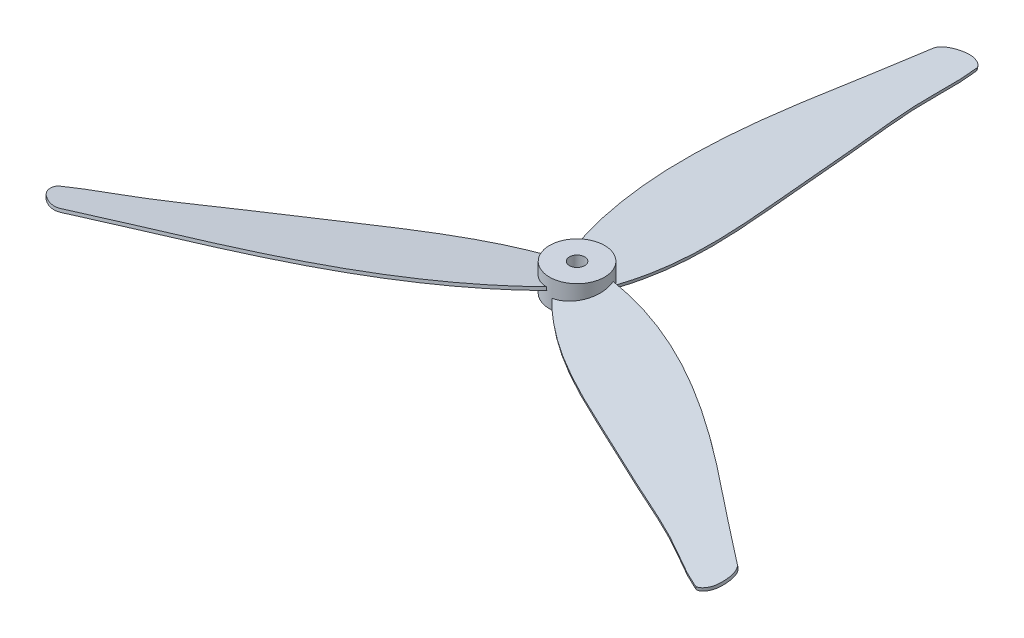
ISO-10303-21;
HEADER;
FILE_DESCRIPTION(('STEP AP214'),'2;1');
FILE_NAME('part.step','',(''),(''),'','','');
FILE_SCHEMA(('AUTOMOTIVE_DESIGN { 1 0 10303 214 1 1 1 1 }'));
ENDSEC;
DATA;
#1=APPLICATION_CONTEXT('core data for automotive mechanical design processes');
#2=APPLICATION_PROTOCOL_DEFINITION('international standard','automotive_design',2000,#1);
#3=PRODUCT_CONTEXT('',#1,'mechanical');
#4=PRODUCT('Part','Part','',(#3));
#5=PRODUCT_RELATED_PRODUCT_CATEGORY('part','',(#4));
#6=PRODUCT_DEFINITION_FORMATION('','',#4);
#7=PRODUCT_DEFINITION_CONTEXT('part definition',#1,'design');
#8=PRODUCT_DEFINITION('design','',#6,#7);
#9=PRODUCT_DEFINITION_SHAPE('','',#8);
#10=(LENGTH_UNIT() NAMED_UNIT(*) SI_UNIT(.MILLI.,.METRE.));
#11=(NAMED_UNIT(*) PLANE_ANGLE_UNIT() SI_UNIT($,.RADIAN.));
#12=(NAMED_UNIT(*) SI_UNIT($,.STERADIAN.) SOLID_ANGLE_UNIT());
#13=UNCERTAINTY_MEASURE_WITH_UNIT(LENGTH_MEASURE(1.E-05),#10,'distance_accuracy_value','');
#14=(GEOMETRIC_REPRESENTATION_CONTEXT(3) GLOBAL_UNCERTAINTY_ASSIGNED_CONTEXT((#13)) GLOBAL_UNIT_ASSIGNED_CONTEXT((#10,
#11,#12)) REPRESENTATION_CONTEXT('',''));
#15=CARTESIAN_POINT('',(0.,0.,0.));
#16=DIRECTION('',(0.,0.,1.));
#17=DIRECTION('',(1.,0.,0.));
#18=AXIS2_PLACEMENT_3D('',#15,#16,#17);
#19=CARTESIAN_POINT('',(0.,9.,0.));
#20=DIRECTION('',(0.,-1.,0.));
#21=DIRECTION('',(0.,0.,-1.));
#22=AXIS2_PLACEMENT_3D('',#19,#20,#21);
#23=CYLINDRICAL_SURFACE('',#22,9.);
#24=CARTESIAN_POINT('',(0.,3.54362794025801,0.));
#25=DIRECTION('',(0.156434465040231,0.987688340595138,0.));
#26=DIRECTION('',(0.987688340595138,-0.156434465040231,0.));
#27=AXIS2_PLACEMENT_3D('',#24,#25,#26);
#28=ELLIPSE('',#27,9.11218613209203,9.);
#29=CARTESIAN_POINT('',(7.30430784711758,2.38673922993417,-5.25804972157326));
#30=VERTEX_POINT('',#29);
#31=CARTESIAN_POINT('',(-7.28372938367546,4.69725734216683,-5.2865192958489));
#32=VERTEX_POINT('',#31);
#33=EDGE_CURVE('E96',#30,#32,#28,.T.);
#34=ORIENTED_EDGE('',*,*,#33,.F.);
#35=CARTESIAN_POINT('',(7.41620379576395,3.38148177852124,-5.09901179246494));
#36=CARTESIAN_POINT('',(7.39770465756707,3.21573761419823,-5.12591312980971));
#37=CARTESIAN_POINT('',(7.37913042608144,3.04997031965447,-5.15261695924113));
#38=CARTESIAN_POINT('',(7.34183177653266,2.71838947012545,-5.20562960227724));
#39=CARTESIAN_POINT('',(7.3231073584695,2.55257591514019,-5.23193841588193));
#40=CARTESIAN_POINT('',(7.30430784711759,2.38673922993417,-5.25804972157327));
#41=B_SPLINE_CURVE_WITH_KNOTS('',3,(#35,#36,#37,#38,#39,#40),.UNSPECIFIED.,.F.,.F.,(4,2,4),(0.,
0.506785983130427,1.01357196626085),.UNSPECIFIED.);
#42=CARTESIAN_POINT('',(7.41620379576395,3.38148177852124,-5.09901179246494));
#43=VERTEX_POINT('',#42);
#44=EDGE_CURVE('E163',#43,#30,#41,.T.);
#45=ORIENTED_EDGE('',*,*,#44,.F.);
#46=CARTESIAN_POINT('',(0.,4.55609306604602,0.));
#47=DIRECTION('',(0.156434465040231,0.987688340595138,0.));
#48=DIRECTION('',(0.987688340595138,-0.156434465040231,0.));
#49=AXIS2_PLACEMENT_3D('',#46,#47,#48);
#50=ELLIPSE('',#49,9.11218613209203,9.);
#51=CARTESIAN_POINT('',(-7.17614569150034,5.69268288508163,-5.43166024474664));
#52=VERTEX_POINT('',#51);
#53=EDGE_CURVE('E183',#43,#52,#50,.T.);
#54=ORIENTED_EDGE('',*,*,#53,.T.);
#55=CARTESIAN_POINT('',(-7.28372938367546,4.69725734216683,-5.28651929584885));
#56=CARTESIAN_POINT('',(-7.26593509251969,4.86312914673476,-5.31103307316615));
#57=CARTESIAN_POINT('',(-7.24807263926054,5.02901717759495,-5.33538504089962));
#58=CARTESIAN_POINT('',(-7.2122114085355,5.36082569189989,-5.38376535719889));
#59=CARTESIAN_POINT('',(-7.1942126310696,5.52674617534463,-5.40779370576468));
#60=CARTESIAN_POINT('',(-7.17614569150033,5.69268288508163,-5.43166024474664));
#61=B_SPLINE_CURVE_WITH_KNOTS('',3,(#55,#56,#57,#58,#59,#60),.UNSPECIFIED.,.F.,.F.,(4,2,4),(0.,
0.505844164901021,1.01168832980204),.UNSPECIFIED.);
#62=EDGE_CURVE('E170',#32,#52,#61,.T.);
#63=ORIENTED_EDGE('',*,*,#62,.F.);
#64=EDGE_LOOP('',(#34,#45,#54,#63));
#65=FACE_BOUND('',#64,.T.);
#66=CARTESIAN_POINT('',(0.,0.,0.));
#67=DIRECTION('',(0.,1.,0.));
#68=DIRECTION('',(0.,0.,1.));
#69=AXIS2_PLACEMENT_3D('',#66,#67,#68);
#70=CIRCLE('',#69,9.);
#71=CARTESIAN_POINT('',(0.,0.,9.));
#72=VERTEX_POINT('',#71);
#73=EDGE_CURVE('E229',#72,#72,#70,.T.);
#74=ORIENTED_EDGE('',*,*,#73,.T.);
#75=EDGE_LOOP('',(#74));
#76=FACE_BOUND('',#75,.T.);
#77=CARTESIAN_POINT('',(0.,9.,0.));
#78=DIRECTION('',(0.,1.,0.));
#79=DIRECTION('',(0.,0.,1.));
#80=AXIS2_PLACEMENT_3D('',#77,#78,#79);
#81=CIRCLE('',#80,9.);
#82=CARTESIAN_POINT('',(0.,9.,9.));
#83=VERTEX_POINT('',#82);
#84=EDGE_CURVE('E232',#83,#83,#81,.T.);
#85=ORIENTED_EDGE('',*,*,#84,.F.);
#86=EDGE_LOOP('',(#85));
#87=FACE_BOUND('',#86,.T.);
#88=CARTESIAN_POINT('',(0.,3.54362794025801,0.));
#89=DIRECTION('',(-0.0782172325201163,0.987688340595138,0.135476220752269));
#90=DIRECTION('',(-0.493844170297573,-0.156434465040231,0.855363193977084));
#91=AXIS2_PLACEMENT_3D('',#88,#89,#90);
#92=ELLIPSE('',#91,9.11218613209203,9.);
#93=CARTESIAN_POINT('',(0.901450709685308,2.38673922993417,8.95474101345248));
#94=VERTEX_POINT('',#93);
#95=CARTESIAN_POINT('',(8.22012469963952,4.69725734216683,-3.66463503262963));
#96=VERTEX_POINT('',#95);
#97=EDGE_CURVE('E184',#94,#96,#92,.T.);
#98=ORIENTED_EDGE('',*,*,#97,.F.);
#99=CARTESIAN_POINT('',(0.707771848589028,3.38148177852124,8.97212678300662));
#100=CARTESIAN_POINT('',(0.740318659223825,3.21573761419823,8.9695567280524));
#101=CARTESIAN_POINT('',(0.77273196963258,3.04997031965448,8.96682288644578));
#102=CARTESIAN_POINT('',(0.837291589998006,2.71838947012545,8.96102762992774));
#103=CARTESIAN_POINT('',(0.869437899954678,2.55257591514019,8.95796621501631));
#104=CARTESIAN_POINT('',(0.901450709685308,2.38673922993417,8.95474101345248));
#105=B_SPLINE_CURVE_WITH_KNOTS('',3,(#99,#100,#101,#102,#103,#104),.UNSPECIFIED.,.F.,.F.,(4,2,
4),(0.,0.506785983130426,1.01357196626085),.UNSPECIFIED.);
#106=CARTESIAN_POINT('',(0.707771848589048,3.38148177852124,8.97212678300663));
#107=VERTEX_POINT('',#106);
#108=EDGE_CURVE('E195',#107,#94,#105,.T.);
#109=ORIENTED_EDGE('',*,*,#108,.F.);
#110=CARTESIAN_POINT('',(0.,4.55609306604602,0.));
#111=DIRECTION('',(-0.0782172325201163,0.987688340595138,0.135476220752269));
#112=DIRECTION('',(-0.493844170297573,-0.156434465040231,0.855363193977084));
#113=AXIS2_PLACEMENT_3D('',#110,#111,#112);
#114=ELLIPSE('',#113,9.11218613209203,9.);
#115=CARTESIAN_POINT('',(8.29202860242678,5.69268288508163,-3.49889434772418));
#116=VERTEX_POINT('',#115);
#117=EDGE_CURVE('E235',#107,#116,#114,.T.);
#118=ORIENTED_EDGE('',*,*,#117,.T.);
#119=CARTESIAN_POINT('',(8.22012469963947,4.69725734216683,-3.66463503262966));
#120=CARTESIAN_POINT('',(8.23245710796109,4.86312914673476,-3.63696783578777));
#121=CARTESIAN_POINT('',(8.24461530402083,5.02901717759496,-3.6093225136247));
#122=CARTESIAN_POINT('',(8.2685832716166,5.36082569189989,-3.55407561865621));
#123=CARTESIAN_POINT('',(8.28039304315262,5.52674617534463,-3.52647404585078));
#124=CARTESIAN_POINT('',(8.29202860242678,5.69268288508163,-3.49889434772418));
#125=B_SPLINE_CURVE_WITH_KNOTS('',3,(#119,#120,#121,#122,#123,#124),.UNSPECIFIED.,.F.,.F.,(4,2,
4),(0.,0.505844164901022,1.01168832980204),.UNSPECIFIED.);
#126=EDGE_CURVE('E185',#96,#116,#125,.T.);
#127=ORIENTED_EDGE('',*,*,#126,.F.);
#128=EDGE_LOOP('',(#98,#109,#118,#127));
#129=FACE_BOUND('',#128,.T.);
#130=CARTESIAN_POINT('',(0.,3.54362794025801,0.));
#131=DIRECTION('',(-0.0782172325201162,0.987688340595138,-0.135476220752269));
#132=DIRECTION('',(-0.493844170297573,-0.156434465040231,-0.855363193977084));
#133=AXIS2_PLACEMENT_3D('',#130,#131,#132);
#134=ELLIPSE('',#133,9.11218613209203,9.);
#135=CARTESIAN_POINT('',(-8.20575855680295,2.38673922993417,-3.69669129187918));
#136=VERTEX_POINT('',#135);
#137=CARTESIAN_POINT('',(-0.936395315964,4.69725734216683,8.95115432847857));
#138=VERTEX_POINT('',#137);
#139=EDGE_CURVE('E11',#136,#138,#134,.T.);
#140=ORIENTED_EDGE('',*,*,#139,.F.);
#141=CARTESIAN_POINT('',(-8.12397564435305,3.38148177852123,-3.87311499054165));
#142=CARTESIAN_POINT('',(-8.13802331679097,3.21573761419823,-3.84364359824265));
#143=CARTESIAN_POINT('',(-8.15186239571408,3.04997031965447,-3.81420592720461));
#144=CARTESIAN_POINT('',(-8.17912336653072,2.71838947012545,-3.75539802765046));
#145=CARTESIAN_POINT('',(-8.19254525842424,2.55257591514019,-3.72602779913434));
#146=CARTESIAN_POINT('',(-8.20575855680295,2.38673922993418,-3.69669129187918));
#147=B_SPLINE_CURVE_WITH_KNOTS('',3,(#141,#142,#143,#144,#145,#146),.UNSPECIFIED.,.F.,.F.,(4,2,
4),(0.,0.50678598313042,1.01357196626084),.UNSPECIFIED.);
#148=CARTESIAN_POINT('',(-8.12397564435306,3.38148177852124,-3.87311499054165));
#149=VERTEX_POINT('',#148);
#150=EDGE_CURVE('E95',#149,#136,#147,.T.);
#151=ORIENTED_EDGE('',*,*,#150,.F.);
#152=CARTESIAN_POINT('',(0.,4.55609306604602,0.));
#153=DIRECTION('',(-0.0782172325201162,0.987688340595138,-0.135476220752269));
#154=DIRECTION('',(-0.493844170297573,-0.156434465040231,-0.855363193977084));
#155=AXIS2_PLACEMENT_3D('',#152,#153,#154);
#156=ELLIPSE('',#155,9.11218613209203,9.);
#157=CARTESIAN_POINT('',(-1.11588291092639,5.69268288508163,8.93055459247086));
#158=VERTEX_POINT('',#157);
#159=EDGE_CURVE('E90',#149,#158,#156,.T.);
#160=ORIENTED_EDGE('',*,*,#159,.T.);
#161=CARTESIAN_POINT('',(-0.936395315963954,4.69725734216683,8.95115432847855));
#162=CARTESIAN_POINT('',(-0.966522015441339,4.86312914673476,8.94800090895396));
#163=CARTESIAN_POINT('',(-0.996542664760233,5.02901717759495,8.94470755452437));
#164=CARTESIAN_POINT('',(-1.05637186308104,5.36082569189988,8.93784097585514));
#165=CARTESIAN_POINT('',(-1.08618041208296,5.52674617534462,8.93426775161551));
#166=CARTESIAN_POINT('',(-1.11588291092638,5.69268288508162,8.93055459247086));
#167=B_SPLINE_CURVE_WITH_KNOTS('',3,(#161,#162,#163,#164,#165,#166),.UNSPECIFIED.,.F.,.F.,(4,2,
4),(0.,0.505844164901016,1.01168832980203),.UNSPECIFIED.);
#168=EDGE_CURVE('E48',#138,#158,#167,.T.);
#169=ORIENTED_EDGE('',*,*,#168,.F.);
#170=EDGE_LOOP('',(#140,#151,#160,#169));
#171=FACE_BOUND('',#170,.T.);
#172=ADVANCED_FACE('F40',(#65,#76,#87,#129,#171),#23,.T.);
#173=CARTESIAN_POINT('',(0.,9.,0.));
#174=DIRECTION('',(0.,1.,0.));
#175=DIRECTION('',(0.,0.,1.));
#176=AXIS2_PLACEMENT_3D('',#173,#174,#175);
#177=PLANE('',#176);
#178=ORIENTED_EDGE('',*,*,#84,.T.);
#179=EDGE_LOOP('',(#178));
#180=FACE_BOUND('',#179,.T.);
#181=CARTESIAN_POINT('',(0.,9.,0.));
#182=DIRECTION('',(0.,1.,0.));
#183=DIRECTION('',(0.,0.,1.));
#184=AXIS2_PLACEMENT_3D('',#181,#182,#183);
#185=CIRCLE('',#184,2.5);
#186=CARTESIAN_POINT('',(0.,9.,2.5));
#187=VERTEX_POINT('',#186);
#188=EDGE_CURVE('E223',#187,#187,#185,.T.);
#189=ORIENTED_EDGE('',*,*,#188,.F.);
#190=EDGE_LOOP('',(#189));
#191=FACE_BOUND('',#190,.T.);
#192=ADVANCED_FACE('F245',(#180,#191),#177,.T.);
#193=CARTESIAN_POINT('',(0.,0.,0.));
#194=DIRECTION('',(0.,1.,0.));
#195=DIRECTION('',(0.,0.,1.));
#196=AXIS2_PLACEMENT_3D('',#193,#194,#195);
#197=PLANE('',#196);
#198=ORIENTED_EDGE('',*,*,#73,.F.);
#199=EDGE_LOOP('',(#198));
#200=FACE_BOUND('',#199,.T.);
#201=CARTESIAN_POINT('',(0.,0.,0.));
#202=DIRECTION('',(0.,1.,0.));
#203=DIRECTION('',(0.,0.,1.));
#204=AXIS2_PLACEMENT_3D('',#201,#202,#203);
#205=CIRCLE('',#204,2.5);
#206=CARTESIAN_POINT('',(0.,0.,2.5));
#207=VERTEX_POINT('',#206);
#208=EDGE_CURVE('E215',#207,#207,#205,.T.);
#209=ORIENTED_EDGE('',*,*,#208,.T.);
#210=EDGE_LOOP('',(#209));
#211=FACE_BOUND('',#210,.T.);
#212=ADVANCED_FACE('F250',(#200,#211),#197,.F.);
#213=CARTESIAN_POINT('',(0.,9.,0.));
#214=DIRECTION('',(0.,-1.,0.));
#215=DIRECTION('',(0.,0.,-1.));
#216=AXIS2_PLACEMENT_3D('',#213,#214,#215);
#217=CYLINDRICAL_SURFACE('',#216,2.5);
#218=ORIENTED_EDGE('',*,*,#188,.T.);
#219=EDGE_LOOP('',(#218));
#220=FACE_BOUND('',#219,.T.);
#221=ORIENTED_EDGE('',*,*,#208,.F.);
#222=EDGE_LOOP('',(#221));
#223=FACE_BOUND('',#222,.T.);
#224=ADVANCED_FACE('F205',(#220,#223),#217,.F.);
#225=CARTESIAN_POINT('',(6.07128886437522,4.58317983054747,-4.07358476355836));
#226=CARTESIAN_POINT('',(30.0274191154173,5.88967505732956,0.232500129810801));
#227=CARTESIAN_POINT('',(65.3611569346111,5.90057996757105,20.5529410073428));
#228=CARTESIAN_POINT('',(95.6678257611402,4.77268380270435,46.2734226874995));
#229=CARTESIAN_POINT('',(110.338679272948,4.43565398162164,57.2007572182211));
#230=CARTESIAN_POINT('',(110.888971991819,3.8453898245611,61.8217851437842));
#231=CARTESIAN_POINT('',(109.606010039389,3.14844611510895,66.1621294437965));
#232=CARTESIAN_POINT('',(106.812806514418,2.73477342422366,67.5653501932813));
#233=CARTESIAN_POINT('',(105.316603334889,2.7101153798658,66.8812861666804));
#234=CARTESIAN_POINT('',(99.7791919174203,2.61715864183006,64.3619605745815));
#235=CARTESIAN_POINT('',(88.5197573784138,2.72077298483617,57.1059234454856));
#236=CARTESIAN_POINT('',(70.2021946473294,2.3700309638207,49.0873556658917));
#237=CARTESIAN_POINT('',(39.3058016566439,2.0131199885944,33.8513715628341));
#238=CARTESIAN_POINT('',(14.3923305409287,1.52115674879017,23.0542265062131));
#239=CARTESIAN_POINT('',(0.244924495635226,2.42772974256338,8.27685441144336));
#240=B_SPLINE_CURVE_WITH_KNOTS('',3,(#225,#226,#227,#228,#229,#230,#231,#232,#233,#234,#235,
#236,#237,#238,#239),.UNSPECIFIED.,.F.,.F.,(4,1,1,1,1,1,1,1,1,1,1,1,4),(0.,0.28293344669307,
0.466482550178483,0.471857061893158,0.495005991949986,0.514382548074224,0.523354602147642,
0.526650828201052,0.53318720122455,0.595375397845292,0.68247325334402,0.76793576336452,1.),.UNSPECIFIED.);
#241=DIRECTION('',(-0.0782172325201162,0.987688340595138,0.135476220752268));
#242=VECTOR('',#241,1.);
#243=SURFACE_OF_LINEAR_EXTRUSION('',#240,#242);
#244=EDGE_CURVE('E209',#96,#94,#240,.T.);
#245=ORIENTED_EDGE('',*,*,#244,.F.);
#246=ORIENTED_EDGE('',*,*,#126,.T.);
#247=CARTESIAN_POINT('',(5.9930716318551,5.57086817114261,-3.93810854280609));
#248=CARTESIAN_POINT('',(29.9492018828972,6.8773633979247,0.367976350563069));
#249=CARTESIAN_POINT('',(65.2829397020909,6.88826830816618,20.6884172280951));
#250=CARTESIAN_POINT('',(95.58960852862,5.76037214329949,46.4088989082518));
#251=CARTESIAN_POINT('',(110.260462040428,5.42334232221677,57.3362334389734));
#252=CARTESIAN_POINT('',(110.810754759299,4.83307816515624,61.9572613645364));
#253=CARTESIAN_POINT('',(109.527792806869,4.13613445570409,66.2976056645488));
#254=CARTESIAN_POINT('',(106.734589281898,3.7224617648188,67.7008264140335));
#255=CARTESIAN_POINT('',(105.238386102369,3.69780372046094,67.0167623874327));
#256=CARTESIAN_POINT('',(99.7009746849001,3.6048469824252,64.4974367953338));
#257=CARTESIAN_POINT('',(88.4415401458937,3.70846132543131,57.2413996662378));
#258=CARTESIAN_POINT('',(70.1239774148093,3.35771930441584,49.222831886644));
#259=CARTESIAN_POINT('',(39.2275844241237,3.00080832918954,33.9868477835864));
#260=CARTESIAN_POINT('',(14.3141133084086,2.50884508938531,23.1897027269654));
#261=CARTESIAN_POINT('',(0.16670726311511,3.41541808315852,8.41233063219563));
#262=B_SPLINE_CURVE_WITH_KNOTS('',3,(#247,#248,#249,#250,#251,#252,#253,#254,#255,#256,#257,
#258,#259,#260,#261),.UNSPECIFIED.,.F.,.F.,(4,1,1,1,1,1,1,1,1,1,1,1,4),(0.,0.28293344669307,
0.466482550178483,0.471857061893158,0.495005991949986,0.514382548074224,0.523354602147642,
0.526650828201052,0.53318720122455,0.595375397845292,0.68247325334402,0.76793576336452,1.),.UNSPECIFIED.);
#263=EDGE_CURVE('E145',#116,#107,#262,.T.);
#264=ORIENTED_EDGE('',*,*,#263,.T.);
#265=ORIENTED_EDGE('',*,*,#108,.T.);
#266=EDGE_LOOP('',(#245,#246,#264,#265));
#267=FACE_BOUND('',#266,.T.);
#268=ADVANCED_FACE('F201',(#267),#243,.F.);
#269=CARTESIAN_POINT('',(110.275945295483,3.5873097675363,63.3493846772373));
#270=DIRECTION('',(-0.0782172325201163,0.987688340595138,0.135476220752269));
#271=DIRECTION('',(0.,-0.135892549420804,0.9907235815362));
#272=AXIS2_PLACEMENT_3D('',#269,#270,#271);
#273=PLANE('',#272);
#274=ORIENTED_EDGE('',*,*,#244,.T.);
#275=ORIENTED_EDGE('',*,*,#97,.T.);
#276=EDGE_LOOP('',(#274,#275));
#277=FACE_BOUND('',#276,.T.);
#278=ADVANCED_FACE('F159',(#277),#273,.F.);
#279=CARTESIAN_POINT('',(110.197728062963,4.57499810813144,63.4848608979895));
#280=DIRECTION('',(-0.0782172325201163,0.987688340595138,0.135476220752269));
#281=DIRECTION('',(0.,-0.135892549420804,0.9907235815362));
#282=AXIS2_PLACEMENT_3D('',#279,#280,#281);
#283=PLANE('',#282);
#284=ORIENTED_EDGE('',*,*,#117,.F.);
#285=ORIENTED_EDGE('',*,*,#263,.F.);
#286=EDGE_LOOP('',(#284,#285));
#287=FACE_BOUND('',#286,.T.);
#288=ADVANCED_FACE('F157',(#287),#283,.T.);
#289=CARTESIAN_POINT('',(-6.56347232189839,4.58317983054747,-3.22109800848331));
#290=CARTESIAN_POINT('',(-14.8123585389095,5.88967505732956,-26.1207578289392));
#291=CARTESIAN_POINT('',(-14.8812094324641,5.90057996757105,-66.8808928297859));
#292=CARTESIAN_POINT('',(-7.75995331314078,4.77268380270435,-105.98747877772));
#293=CARTESIAN_POINT('',(-5.63203076978911,4.43565398162164,-124.156477879507));
#294=CARTESIAN_POINT('',(-1.90524955408981,3.8453898245611,-126.943559316349));
#295=CARTESIAN_POINT('',(2.49507984710695,3.14844611510895,-128.002653823462));
#296=CARTESIAN_POINT('',(5.10690642576363,2.73477342422366,-126.285278987639));
#297=CARTESIAN_POINT('',(5.26259119067698,2.7101153798658,-124.647497011643));
#298=CARTESIAN_POINT('',(5.84949693624938,2.61715864183006,-118.59229525686));
#299=CARTESIAN_POINT('',(5.1953017211525,2.72077298483617,-105.213320349284));
#300=CARTESIAN_POINT('',(7.4097996875991,2.3700309638207,-85.3405617989531));
#301=CARTESIAN_POINT('',(9.66324689803829,2.0131199885944,-50.9655085321832));
#302=CARTESIAN_POINT('',(12.7693805485167,1.52115674879017,-23.9912371212135));
#303=CARTESIAN_POINT('',(7.04550393591762,2.42772974256338,-4.35053804095091));
#304=B_SPLINE_CURVE_WITH_KNOTS('',3,(#289,#290,#291,#292,#293,#294,#295,#296,#297,#298,#299,
#300,#301,#302,#303),.UNSPECIFIED.,.F.,.F.,(4,1,1,1,1,1,1,1,1,1,1,1,4),(0.,0.28293344669307,
0.466482550178483,0.471857061893158,0.495005991949986,0.514382548074224,0.523354602147642,
0.526650828201052,0.53318720122455,0.595375397845292,0.68247325334402,0.76793576336452,1.),.UNSPECIFIED.);
#305=DIRECTION('',(0.156434465040231,0.987688340595138,0.));
#306=VECTOR('',#305,1.);
#307=SURFACE_OF_LINEAR_EXTRUSION('',#304,#306);
#308=EDGE_CURVE('E136',#32,#30,#304,.T.);
#309=ORIENTED_EDGE('',*,*,#308,.F.);
#310=ORIENTED_EDGE('',*,*,#62,.T.);
#311=CARTESIAN_POINT('',(-6.40703785685816,5.57086817114261,-3.22109800848331));
#312=CARTESIAN_POINT('',(-14.6559240738692,6.8773633979247,-26.1207578289392));
#313=CARTESIAN_POINT('',(-14.7247749674238,6.88826830816618,-66.8808928297859));
#314=CARTESIAN_POINT('',(-7.60351884810055,5.76037214329949,-105.98747877772));
#315=CARTESIAN_POINT('',(-5.47559630474888,5.42334232221677,-124.156477879507));
#316=CARTESIAN_POINT('',(-1.74881508904958,4.83307816515624,-126.943559316349));
#317=CARTESIAN_POINT('',(2.65151431214718,4.13613445570409,-128.002653823462));
#318=CARTESIAN_POINT('',(5.26334089080386,3.7224617648188,-126.285278987639));
#319=CARTESIAN_POINT('',(5.41902565571722,3.69780372046094,-124.647497011643));
#320=CARTESIAN_POINT('',(6.00593140128962,3.6048469824252,-118.59229525686));
#321=CARTESIAN_POINT('',(5.35173618619274,3.70846132543131,-105.213320349284));
#322=CARTESIAN_POINT('',(7.56623415263933,3.35771930441584,-85.3405617989531));
#323=CARTESIAN_POINT('',(9.81968136307852,3.00080832918954,-50.9655085321832));
#324=CARTESIAN_POINT('',(12.9258150135569,2.50884508938531,-23.9912371212135));
#325=CARTESIAN_POINT('',(7.20193840095785,3.41541808315852,-4.35053804095091));
#326=B_SPLINE_CURVE_WITH_KNOTS('',3,(#311,#312,#313,#314,#315,#316,#317,#318,#319,#320,#321,
#322,#323,#324,#325),.UNSPECIFIED.,.F.,.F.,(4,1,1,1,1,1,1,1,1,1,1,1,4),(0.,0.28293344669307,
0.466482550178483,0.471857061893158,0.495005991949986,0.514382548074224,0.523354602147642,
0.526650828201052,0.53318720122455,0.595375397845292,0.68247325334402,0.76793576336452,1.),.UNSPECIFIED.);
#327=EDGE_CURVE('E61',#52,#43,#326,.T.);
#328=ORIENTED_EDGE('',*,*,#327,.T.);
#329=ORIENTED_EDGE('',*,*,#44,.T.);
#330=EDGE_LOOP('',(#309,#310,#328,#329));
#331=FACE_BOUND('',#330,.T.);
#332=ADVANCED_FACE('F153',(#331),#307,.F.);
#333=CARTESIAN_POINT('',(-0.275796203142048,3.5873097675363,-127.17646239085));
#334=DIRECTION('',(0.156434465040231,0.987688340595138,0.));
#335=DIRECTION('',(0.85799178973865,-0.135892549420804,-0.495361790768104));
#336=AXIS2_PLACEMENT_3D('',#333,#334,#335);
#337=PLANE('',#336);
#338=ORIENTED_EDGE('',*,*,#308,.T.);
#339=ORIENTED_EDGE('',*,*,#33,.T.);
#340=EDGE_LOOP('',(#338,#339));
#341=FACE_BOUND('',#340,.T.);
#342=ADVANCED_FACE('F124',(#341),#337,.F.);
#343=CARTESIAN_POINT('',(-0.119361738101816,4.57499810813144,-127.17646239085));
#344=DIRECTION('',(0.156434465040231,0.987688340595138,0.));
#345=DIRECTION('',(0.85799178973865,-0.135892549420804,-0.495361790768104));
#346=AXIS2_PLACEMENT_3D('',#343,#344,#345);
#347=PLANE('',#346);
#348=ORIENTED_EDGE('',*,*,#53,.F.);
#349=ORIENTED_EDGE('',*,*,#327,.F.);
#350=EDGE_LOOP('',(#348,#349));
#351=FACE_BOUND('',#350,.T.);
#352=ADVANCED_FACE('F122',(#351),#347,.T.);
#353=CARTESIAN_POINT('',(0.492183457523219,4.58317983054747,7.29468277204169));
#354=CARTESIAN_POINT('',(-15.2150605765078,5.88967505732956,25.8882576991286));
#355=CARTESIAN_POINT('',(-50.4799475021469,5.90057996757105,46.3279518224437));
#356=CARTESIAN_POINT('',(-87.9078724479993,4.77268380270435,59.7140560902217));
#357=CARTESIAN_POINT('',(-104.706648503159,4.43565398162164,66.9557206612871));
#358=CARTESIAN_POINT('',(-108.98372243773,3.8453898245611,65.1217741725657));
#359=CARTESIAN_POINT('',(-112.101089886496,3.14844611510895,61.8405243796661));
#360=CARTESIAN_POINT('',(-111.919712940182,2.73477342422366,58.7199287943587));
#361=CARTESIAN_POINT('',(-110.579194525566,2.7101153798658,57.7662108449635));
#362=CARTESIAN_POINT('',(-105.62868885367,2.61715864183006,54.2303346822791));
#363=CARTESIAN_POINT('',(-93.7150590995663,2.72077298483617,48.1073969037994));
#364=CARTESIAN_POINT('',(-77.6119943349286,2.3700309638207,36.2532061330621));
#365=CARTESIAN_POINT('',(-48.9690485546822,2.0131199885944,17.1141369693495));
#366=CARTESIAN_POINT('',(-27.1617110894455,1.52115674879017,0.93701061500056));
#367=CARTESIAN_POINT('',(-7.2904284315529,2.42772974256338,-3.92631637049242));
#368=B_SPLINE_CURVE_WITH_KNOTS('',3,(#353,#354,#355,#356,#357,#358,#359,#360,#361,#362,#363,
#364,#365,#366,#367),.UNSPECIFIED.,.F.,.F.,(4,1,1,1,1,1,1,1,1,1,1,1,4),(0.,0.28293344669307,
0.466482550178483,0.471857061893158,0.495005991949986,0.514382548074224,0.523354602147642,
0.526650828201052,0.53318720122455,0.595375397845292,0.68247325334402,0.76793576336452,1.),.UNSPECIFIED.);
#369=DIRECTION('',(-0.0782172325201162,0.987688340595138,-0.135476220752268));
#370=VECTOR('',#369,1.);
#371=SURFACE_OF_LINEAR_EXTRUSION('',#368,#370);
#372=EDGE_CURVE('E102',#138,#136,#368,.T.);
#373=ORIENTED_EDGE('',*,*,#372,.F.);
#374=ORIENTED_EDGE('',*,*,#168,.T.);
#375=CARTESIAN_POINT('',(0.413966225003103,5.57086817114261,7.15920655128942));
#376=CARTESIAN_POINT('',(-15.2932778090279,6.8773633979247,25.7527814783764));
#377=CARTESIAN_POINT('',(-50.558164734667,6.88826830816618,46.1924756016914));
#378=CARTESIAN_POINT('',(-87.9860896805194,5.76037214329949,59.5785798694695));
#379=CARTESIAN_POINT('',(-104.784865735679,5.42334232221677,66.8202444405348));
#380=CARTESIAN_POINT('',(-109.06193967025,4.83307816515624,64.9862979518134));
#381=CARTESIAN_POINT('',(-112.179307119016,4.13613445570409,61.7050481589139));
#382=CARTESIAN_POINT('',(-111.997930172702,3.7224617648188,58.5844525736064));
#383=CARTESIAN_POINT('',(-110.657411758086,3.69780372046094,57.6307346242112));
#384=CARTESIAN_POINT('',(-105.70690608619,3.6048469824252,54.0948584615268));
#385=CARTESIAN_POINT('',(-93.7932763320864,3.70846132543131,47.9719206830471));
#386=CARTESIAN_POINT('',(-77.6902115674487,3.35771930441584,36.1177299123098));
#387=CARTESIAN_POINT('',(-49.0472657872023,3.00080832918954,16.9786607485972));
#388=CARTESIAN_POINT('',(-27.2399283219656,2.50884508938531,0.801534394248291));
#389=CARTESIAN_POINT('',(-7.36864566407302,3.41541808315852,-4.06179259124468));
#390=B_SPLINE_CURVE_WITH_KNOTS('',3,(#375,#376,#377,#378,#379,#380,#381,#382,#383,#384,#385,
#386,#387,#388,#389),.UNSPECIFIED.,.F.,.F.,(4,1,1,1,1,1,1,1,1,1,1,1,4),(0.,0.28293344669307,
0.466482550178483,0.471857061893158,0.495005991949986,0.514382548074224,0.523354602147642,
0.526650828201052,0.53318720122455,0.595375397845292,0.68247325334402,0.76793576336452,1.),.UNSPECIFIED.);
#391=EDGE_CURVE('E54',#158,#149,#390,.T.);
#392=ORIENTED_EDGE('',*,*,#391,.T.);
#393=ORIENTED_EDGE('',*,*,#150,.T.);
#394=EDGE_LOOP('',(#373,#374,#392,#393));
#395=FACE_BOUND('',#394,.T.);
#396=ADVANCED_FACE('F100',(#395),#371,.F.);
#397=CARTESIAN_POINT('',(-110.000149092341,3.5873097675363,63.8270777136139));
#398=DIRECTION('',(-0.0782172325201162,0.987688340595138,-0.135476220752269));
#399=DIRECTION('',(-0.857991789738657,-0.135892549420804,-0.495361790768092));
#400=AXIS2_PLACEMENT_3D('',#397,#398,#399);
#401=PLANE('',#400);
#402=ORIENTED_EDGE('',*,*,#372,.T.);
#403=ORIENTED_EDGE('',*,*,#139,.T.);
#404=EDGE_LOOP('',(#402,#403));
#405=FACE_BOUND('',#404,.T.);
#406=ADVANCED_FACE('F121',(#405),#401,.F.);
#407=CARTESIAN_POINT('',(-110.078366324861,4.57499810813144,63.6916014928616));
#408=DIRECTION('',(-0.0782172325201162,0.987688340595138,-0.135476220752269));
#409=DIRECTION('',(-0.857991789738657,-0.135892549420804,-0.495361790768092));
#410=AXIS2_PLACEMENT_3D('',#407,#408,#409);
#411=PLANE('',#410);
#412=ORIENTED_EDGE('',*,*,#159,.F.);
#413=ORIENTED_EDGE('',*,*,#391,.F.);
#414=EDGE_LOOP('',(#412,#413));
#415=FACE_BOUND('',#414,.T.);
#416=ADVANCED_FACE('F91',(#415),#411,.T.);
#417=CLOSED_SHELL('',(#172,#192,#212,#224,#268,#278,#288,#332,#342,#352,#396,#406,#416));
#418=MANIFOLD_SOLID_BREP('B2',#417);
#419=ADVANCED_BREP_SHAPE_REPRESENTATION('',(#18,#418),#14);
#420=SHAPE_DEFINITION_REPRESENTATION(#9,#419);
ENDSEC;
END-ISO-10303-21;
